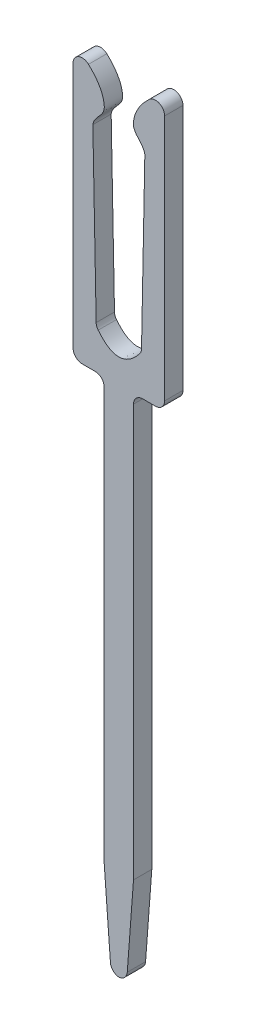
ISO-10303-21;
HEADER;
FILE_DESCRIPTION(('STEP AP214'),'2;1');
FILE_NAME('part.step','',(''),(''),'','','');
FILE_SCHEMA(('AUTOMOTIVE_DESIGN { 1 0 10303 214 1 1 1 1 }'));
ENDSEC;
DATA;
#1=APPLICATION_CONTEXT('core data for automotive mechanical design processes');
#2=APPLICATION_PROTOCOL_DEFINITION('international standard','automotive_design',2000,#1);
#3=PRODUCT_CONTEXT('',#1,'mechanical');
#4=PRODUCT('Part','Part','',(#3));
#5=PRODUCT_RELATED_PRODUCT_CATEGORY('part','',(#4));
#6=PRODUCT_DEFINITION_FORMATION('','',#4);
#7=PRODUCT_DEFINITION_CONTEXT('part definition',#1,'design');
#8=PRODUCT_DEFINITION('design','',#6,#7);
#9=PRODUCT_DEFINITION_SHAPE('','',#8);
#10=(LENGTH_UNIT() NAMED_UNIT(*) SI_UNIT(.MILLI.,.METRE.));
#11=(NAMED_UNIT(*) PLANE_ANGLE_UNIT() SI_UNIT($,.RADIAN.));
#12=(NAMED_UNIT(*) SI_UNIT($,.STERADIAN.) SOLID_ANGLE_UNIT());
#13=UNCERTAINTY_MEASURE_WITH_UNIT(LENGTH_MEASURE(1.E-05),#10,'distance_accuracy_value','');
#14=(GEOMETRIC_REPRESENTATION_CONTEXT(3) GLOBAL_UNCERTAINTY_ASSIGNED_CONTEXT((#13)) GLOBAL_UNIT_ASSIGNED_CONTEXT((#10,
#11,#12)) REPRESENTATION_CONTEXT('',''));
#15=CARTESIAN_POINT('',(0.,0.,0.));
#16=DIRECTION('',(0.,0.,1.));
#17=DIRECTION('',(1.,0.,0.));
#18=AXIS2_PLACEMENT_3D('',#15,#16,#17);
#19=CARTESIAN_POINT('',(0.0155617112013406,-9.53322485209548,-0.2));
#20=DIRECTION('',(0.,0.,1.));
#21=DIRECTION('',(1.,0.,0.));
#22=AXIS2_PLACEMENT_3D('',#19,#20,#21);
#23=CYLINDRICAL_SURFACE('',#22,0.2);
#24=CARTESIAN_POINT('',(0.0155617112013406,-9.53322485209548,0.2));
#25=DIRECTION('',(0.,0.,1.));
#26=DIRECTION('',(-1.,0.,0.));
#27=AXIS2_PLACEMENT_3D('',#24,#25,#26);
#28=CIRCLE('',#27,0.2);
#29=CARTESIAN_POINT('',(-0.183878150776374,-9.54818284174351,0.2));
#30=VERTEX_POINT('',#29);
#31=CARTESIAN_POINT('',(0.,-9.73261851584758,0.2));
#32=VERTEX_POINT('',#31);
#33=EDGE_CURVE('E220',#30,#32,#28,.T.);
#34=ORIENTED_EDGE('',*,*,#33,.F.);
#35=DIRECTION('',(0.,0.,1.));
#36=VECTOR('',#35,1.);
#37=CARTESIAN_POINT('',(-0.183878150776374,-9.54818284174351,-0.2));
#38=LINE('',#37,#36);
#39=CARTESIAN_POINT('',(-0.183878150776374,-9.54818284174351,-0.2));
#40=VERTEX_POINT('',#39);
#41=EDGE_CURVE('E11',#40,#30,#38,.T.);
#42=ORIENTED_EDGE('',*,*,#41,.F.);
#43=CARTESIAN_POINT('',(0.0155617112013406,-9.53322485209548,-0.2));
#44=DIRECTION('',(0.,0.,1.));
#45=DIRECTION('',(-1.,0.,0.));
#46=AXIS2_PLACEMENT_3D('',#43,#44,#45);
#47=CIRCLE('',#46,0.2);
#48=CARTESIAN_POINT('',(0.,-9.73261851584758,-0.2));
#49=VERTEX_POINT('',#48);
#50=EDGE_CURVE('E300',#40,#49,#47,.T.);
#51=ORIENTED_EDGE('',*,*,#50,.T.);
#52=DIRECTION('',(0.,0.,1.));
#53=VECTOR('',#52,1.);
#54=CARTESIAN_POINT('',(0.,-9.73261851584758,-0.2));
#55=LINE('',#54,#53);
#56=EDGE_CURVE('E36',#49,#32,#55,.T.);
#57=ORIENTED_EDGE('',*,*,#56,.T.);
#58=EDGE_LOOP('',(#34,#42,#51,#57));
#59=FACE_BOUND('',#58,.T.);
#60=ADVANCED_FACE('F33',(#59),#23,.T.);
#61=CARTESIAN_POINT('',(-0.183878150776374,-9.54818284174351,-0.2));
#62=DIRECTION('',(-0.997199309888568,-0.074789948240152,0.));
#63=DIRECTION('',(0.074789948240152,-0.997199309888568,0.));
#64=AXIS2_PLACEMENT_3D('',#61,#62,#63);
#65=PLANE('',#64);
#66=DIRECTION('',(0.074789948240152,-0.997199309888568,0.));
#67=VECTOR('',#66,1.);
#68=CARTESIAN_POINT('',(-0.183878150776374,-9.54818284174351,0.2));
#69=LINE('',#68,#67);
#70=CARTESIAN_POINT('',(-0.319999999997298,-7.73322485209503,0.2));
#71=VERTEX_POINT('',#70);
#72=EDGE_CURVE('E298',#71,#30,#69,.T.);
#73=ORIENTED_EDGE('',*,*,#72,.F.);
#74=DIRECTION('',(0.,0.,1.));
#75=VECTOR('',#74,1.);
#76=CARTESIAN_POINT('',(-0.319999999997298,-7.73322485209503,-0.2));
#77=LINE('',#76,#75);
#78=CARTESIAN_POINT('',(-0.319999999997298,-7.73322485209503,-0.2));
#79=VERTEX_POINT('',#78);
#80=EDGE_CURVE('E42',#79,#71,#77,.T.);
#81=ORIENTED_EDGE('',*,*,#80,.F.);
#82=DIRECTION('',(0.074789948240152,-0.997199309888568,0.));
#83=VECTOR('',#82,1.);
#84=CARTESIAN_POINT('',(-0.183878150776374,-9.54818284174351,-0.2));
#85=LINE('',#84,#83);
#86=EDGE_CURVE('E210',#79,#40,#85,.T.);
#87=ORIENTED_EDGE('',*,*,#86,.T.);
#88=ORIENTED_EDGE('',*,*,#41,.T.);
#89=EDGE_LOOP('',(#73,#81,#87,#88));
#90=FACE_BOUND('',#89,.T.);
#91=ADVANCED_FACE('F342',(#90),#65,.T.);
#92=CARTESIAN_POINT('',(-0.319999999997298,-7.73322485209503,-0.2));
#93=DIRECTION('',(-1.,0.,0.));
#94=DIRECTION('',(0.,-1.,0.));
#95=AXIS2_PLACEMENT_3D('',#92,#93,#94);
#96=PLANE('',#95);
#97=DIRECTION('',(0.,-1.,0.));
#98=VECTOR('',#97,1.);
#99=CARTESIAN_POINT('',(-0.319999999997298,-7.73322485209503,0.2));
#100=LINE('',#99,#98);
#101=CARTESIAN_POINT('',(-0.319999999997298,1.26677514790497,0.2));
#102=VERTEX_POINT('',#101);
#103=EDGE_CURVE('E197',#102,#71,#100,.T.);
#104=ORIENTED_EDGE('',*,*,#103,.F.);
#105=DIRECTION('',(0.,0.,1.));
#106=VECTOR('',#105,1.);
#107=CARTESIAN_POINT('',(-0.319999999997298,1.26677514790497,-0.2));
#108=LINE('',#107,#106);
#109=CARTESIAN_POINT('',(-0.319999999997298,1.26677514790497,-0.2));
#110=VERTEX_POINT('',#109);
#111=EDGE_CURVE('E192',#110,#102,#108,.T.);
#112=ORIENTED_EDGE('',*,*,#111,.F.);
#113=DIRECTION('',(0.,-1.,0.));
#114=VECTOR('',#113,1.);
#115=CARTESIAN_POINT('',(-0.319999999997298,-7.73322485209503,-0.2));
#116=LINE('',#115,#114);
#117=EDGE_CURVE('E195',#110,#79,#116,.T.);
#118=ORIENTED_EDGE('',*,*,#117,.T.);
#119=ORIENTED_EDGE('',*,*,#80,.T.);
#120=EDGE_LOOP('',(#104,#112,#118,#119));
#121=FACE_BOUND('',#120,.T.);
#122=ADVANCED_FACE('F194',(#121),#96,.T.);
#123=CARTESIAN_POINT('',(-0.519999999997296,1.26677514790497,-0.2));
#124=DIRECTION('',(0.,0.,1.));
#125=DIRECTION('',(1.,0.,0.));
#126=AXIS2_PLACEMENT_3D('',#123,#124,#125);
#127=CYLINDRICAL_SURFACE('',#126,0.199999999999999);
#128=CARTESIAN_POINT('',(-0.519999999997296,1.26677514790497,0.2));
#129=DIRECTION('',(0.,0.,-1.));
#130=DIRECTION('',(1.,0.,0.));
#131=AXIS2_PLACEMENT_3D('',#128,#129,#130);
#132=CIRCLE('',#131,0.199999999999999);
#133=CARTESIAN_POINT('',(-0.519999999997296,1.46677514790497,0.2));
#134=VERTEX_POINT('',#133);
#135=EDGE_CURVE('E295',#134,#102,#132,.T.);
#136=ORIENTED_EDGE('',*,*,#135,.F.);
#137=DIRECTION('',(0.,0.,1.));
#138=VECTOR('',#137,1.);
#139=CARTESIAN_POINT('',(-0.519999999997296,1.46677514790497,-0.2));
#140=LINE('',#139,#138);
#141=CARTESIAN_POINT('',(-0.519999999997296,1.46677514790497,-0.2));
#142=VERTEX_POINT('',#141);
#143=EDGE_CURVE('E202',#142,#134,#140,.T.);
#144=ORIENTED_EDGE('',*,*,#143,.F.);
#145=CARTESIAN_POINT('',(-0.519999999997296,1.26677514790497,-0.2));
#146=DIRECTION('',(0.,0.,-1.));
#147=DIRECTION('',(1.,0.,0.));
#148=AXIS2_PLACEMENT_3D('',#145,#146,#147);
#149=CIRCLE('',#148,0.199999999999999);
#150=EDGE_CURVE('E208',#142,#110,#149,.T.);
#151=ORIENTED_EDGE('',*,*,#150,.T.);
#152=ORIENTED_EDGE('',*,*,#111,.T.);
#153=EDGE_LOOP('',(#136,#144,#151,#152));
#154=FACE_BOUND('',#153,.T.);
#155=ADVANCED_FACE('F212',(#154),#127,.F.);
#156=CARTESIAN_POINT('',(-0.519999999997296,1.46677514790497,-0.2));
#157=DIRECTION('',(0.,-1.,0.));
#158=DIRECTION('',(0.,0.,-1.));
#159=AXIS2_PLACEMENT_3D('',#156,#157,#158);
#160=PLANE('',#159);
#161=DIRECTION('',(1.,0.,0.));
#162=VECTOR('',#161,1.);
#163=CARTESIAN_POINT('',(-0.519999999997296,1.46677514790497,0.2));
#164=LINE('',#163,#162);
#165=CARTESIAN_POINT('',(-0.799999999997301,1.46677514790497,0.2));
#166=VERTEX_POINT('',#165);
#167=EDGE_CURVE('E292',#166,#134,#164,.T.);
#168=ORIENTED_EDGE('',*,*,#167,.F.);
#169=DIRECTION('',(0.,0.,1.));
#170=VECTOR('',#169,1.);
#171=CARTESIAN_POINT('',(-0.799999999997301,1.46677514790497,-0.2));
#172=LINE('',#171,#170);
#173=CARTESIAN_POINT('',(-0.799999999997301,1.46677514790497,-0.2));
#174=VERTEX_POINT('',#173);
#175=EDGE_CURVE('E304',#174,#166,#172,.T.);
#176=ORIENTED_EDGE('',*,*,#175,.F.);
#177=DIRECTION('',(1.,0.,0.));
#178=VECTOR('',#177,1.);
#179=CARTESIAN_POINT('',(-0.519999999997296,1.46677514790497,-0.2));
#180=LINE('',#179,#178);
#181=EDGE_CURVE('E213',#174,#142,#180,.T.);
#182=ORIENTED_EDGE('',*,*,#181,.T.);
#183=ORIENTED_EDGE('',*,*,#143,.T.);
#184=EDGE_LOOP('',(#168,#176,#182,#183));
#185=FACE_BOUND('',#184,.T.);
#186=ADVANCED_FACE('F355',(#185),#160,.T.);
#187=CARTESIAN_POINT('',(-0.799999999997301,1.66677514790497,-0.2));
#188=DIRECTION('',(0.,0.,1.));
#189=DIRECTION('',(1.,0.,0.));
#190=AXIS2_PLACEMENT_3D('',#187,#188,#189);
#191=CYLINDRICAL_SURFACE('',#190,0.199999999999999);
#192=CARTESIAN_POINT('',(-0.799999999997301,1.66677514790497,0.2));
#193=DIRECTION('',(0.,0.,1.));
#194=DIRECTION('',(-1.,0.,0.));
#195=AXIS2_PLACEMENT_3D('',#192,#193,#194);
#196=CIRCLE('',#195,0.199999999999999);
#197=CARTESIAN_POINT('',(-0.999999999997299,1.66677514790497,0.2));
#198=VERTEX_POINT('',#197);
#199=EDGE_CURVE('E289',#198,#166,#196,.T.);
#200=ORIENTED_EDGE('',*,*,#199,.F.);
#201=DIRECTION('',(0.,0.,1.));
#202=VECTOR('',#201,1.);
#203=CARTESIAN_POINT('',(-0.999999999997299,1.66677514790497,-0.2));
#204=LINE('',#203,#202);
#205=CARTESIAN_POINT('',(-0.999999999997299,1.66677514790497,-0.2));
#206=VERTEX_POINT('',#205);
#207=EDGE_CURVE('E306',#206,#198,#204,.T.);
#208=ORIENTED_EDGE('',*,*,#207,.F.);
#209=CARTESIAN_POINT('',(-0.799999999997301,1.66677514790497,-0.2));
#210=DIRECTION('',(0.,0.,1.));
#211=DIRECTION('',(-1.,0.,0.));
#212=AXIS2_PLACEMENT_3D('',#209,#210,#211);
#213=CIRCLE('',#212,0.199999999999999);
#214=EDGE_CURVE('E215',#206,#174,#213,.T.);
#215=ORIENTED_EDGE('',*,*,#214,.T.);
#216=ORIENTED_EDGE('',*,*,#175,.T.);
#217=EDGE_LOOP('',(#200,#208,#215,#216));
#218=FACE_BOUND('',#217,.T.);
#219=ADVANCED_FACE('F358',(#218),#191,.T.);
#220=CARTESIAN_POINT('',(-0.999999999997299,1.66677514790497,-0.2));
#221=DIRECTION('',(-1.,0.,0.));
#222=DIRECTION('',(0.,0.,1.));
#223=AXIS2_PLACEMENT_3D('',#220,#221,#222);
#224=PLANE('',#223);
#225=DIRECTION('',(0.,-1.,0.));
#226=VECTOR('',#225,1.);
#227=CARTESIAN_POINT('',(-0.999999999997299,1.66677514790497,0.2));
#228=LINE('',#227,#226);
#229=CARTESIAN_POINT('',(-0.999999999997299,7.05719868487585,0.2));
#230=VERTEX_POINT('',#229);
#231=EDGE_CURVE('E286',#230,#198,#228,.T.);
#232=ORIENTED_EDGE('',*,*,#231,.F.);
#233=DIRECTION('',(0.,0.,1.));
#234=VECTOR('',#233,1.);
#235=CARTESIAN_POINT('',(-0.999999999997299,7.05719868487585,-0.2));
#236=LINE('',#235,#234);
#237=CARTESIAN_POINT('',(-0.999999999997299,7.05719868487585,-0.2));
#238=VERTEX_POINT('',#237);
#239=EDGE_CURVE('E308',#238,#230,#236,.T.);
#240=ORIENTED_EDGE('',*,*,#239,.F.);
#241=DIRECTION('',(0.,-1.,0.));
#242=VECTOR('',#241,1.);
#243=CARTESIAN_POINT('',(-0.999999999997299,1.66677514790497,-0.2));
#244=LINE('',#243,#242);
#245=EDGE_CURVE('E393',#238,#206,#244,.T.);
#246=ORIENTED_EDGE('',*,*,#245,.T.);
#247=ORIENTED_EDGE('',*,*,#207,.T.);
#248=EDGE_LOOP('',(#232,#240,#246,#247));
#249=FACE_BOUND('',#248,.T.);
#250=ADVANCED_FACE('F362',(#249),#224,.T.);
#251=CARTESIAN_POINT('',(-0.799999999997313,7.05719868487585,-0.2));
#252=DIRECTION('',(0.,0.,1.));
#253=DIRECTION('',(1.,0.,0.));
#254=AXIS2_PLACEMENT_3D('',#251,#252,#253);
#255=CYLINDRICAL_SURFACE('',#254,0.199999999999987);
#256=CARTESIAN_POINT('',(-0.799999999997313,7.05719868487585,0.2));
#257=DIRECTION('',(0.,0.,1.));
#258=DIRECTION('',(-1.,0.,0.));
#259=AXIS2_PLACEMENT_3D('',#256,#257,#258);
#260=CIRCLE('',#259,0.199999999999987);
#261=CARTESIAN_POINT('',(-0.663039519004161,7.20294444517823,0.2));
#262=VERTEX_POINT('',#261);
#263=EDGE_CURVE('E280',#262,#230,#260,.T.);
#264=ORIENTED_EDGE('',*,*,#263,.F.);
#265=DIRECTION('',(0.,0.,1.));
#266=VECTOR('',#265,1.);
#267=CARTESIAN_POINT('',(-0.663039519004161,7.20294444517823,-0.2));
#268=LINE('',#267,#266);
#269=CARTESIAN_POINT('',(-0.663039519004161,7.20294444517823,-0.2));
#270=VERTEX_POINT('',#269);
#271=EDGE_CURVE('E310',#270,#262,#268,.T.);
#272=ORIENTED_EDGE('',*,*,#271,.F.);
#273=CARTESIAN_POINT('',(-0.799999999997313,7.05719868487585,-0.2));
#274=DIRECTION('',(0.,0.,1.));
#275=DIRECTION('',(-1.,0.,0.));
#276=AXIS2_PLACEMENT_3D('',#273,#274,#275);
#277=CIRCLE('',#276,0.199999999999987);
#278=EDGE_CURVE('E385',#270,#238,#277,.T.);
#279=ORIENTED_EDGE('',*,*,#278,.T.);
#280=ORIENTED_EDGE('',*,*,#239,.T.);
#281=EDGE_LOOP('',(#264,#272,#279,#280));
#282=FACE_BOUND('',#281,.T.);
#283=ADVANCED_FACE('F366',(#282),#255,.T.);
#284=CARTESIAN_POINT('',(-0.567669207755582,6.10834496937554,-0.2));
#285=CARTESIAN_POINT('',(-0.548453887561712,6.27598469580024,-0.2));
#286=CARTESIAN_POINT('',(-0.31067113223224,6.38824738927313,-0.2));
#287=CARTESIAN_POINT('',(-0.326177603548469,6.81615503897428,-0.2));
#288=CARTESIAN_POINT('',(-0.487599251440381,7.03807938574774,-0.2));
#289=CARTESIAN_POINT('',(-0.663039519004161,7.20294444517823,-0.2));
#290=B_SPLINE_CURVE_WITH_KNOTS('',3,(#284,#285,#286,#287,#288,#289),.UNSPECIFIED.,.F.,.F.,(4,1,
1,4),(0.253308427317744,0.546240991694777,0.590136450844154,1.),.UNSPECIFIED.);
#291=DIRECTION('',(0.,0.,1.));
#292=VECTOR('',#291,1.);
#293=SURFACE_OF_LINEAR_EXTRUSION('',#290,#292);
#294=CARTESIAN_POINT('',(-0.567669207755582,6.10834496937554,0.2));
#295=CARTESIAN_POINT('',(-0.548453887561712,6.27598469580024,0.2));
#296=CARTESIAN_POINT('',(-0.31067113223224,6.38824738927313,0.2));
#297=CARTESIAN_POINT('',(-0.326177603548469,6.81615503897428,0.2));
#298=CARTESIAN_POINT('',(-0.487599251440381,7.03807938574774,0.2));
#299=CARTESIAN_POINT('',(-0.663039519004161,7.20294444517823,0.2));
#300=B_SPLINE_CURVE_WITH_KNOTS('',3,(#294,#295,#296,#297,#298,#299),.UNSPECIFIED.,.F.,.F.,(4,1,
1,4),(0.253308427317744,0.546240991694777,0.590136450844154,1.),.UNSPECIFIED.);
#301=CARTESIAN_POINT('',(-0.567669207755582,6.10834496937554,0.2));
#302=VERTEX_POINT('',#301);
#303=EDGE_CURVE('E275',#302,#262,#300,.T.);
#304=ORIENTED_EDGE('',*,*,#303,.F.);
#305=DIRECTION('',(0.,0.,1.));
#306=VECTOR('',#305,1.);
#307=CARTESIAN_POINT('',(-0.567669207755582,6.10834496937554,-0.2));
#308=LINE('',#307,#306);
#309=CARTESIAN_POINT('',(-0.567669207755582,6.10834496937554,-0.2));
#310=VERTEX_POINT('',#309);
#311=EDGE_CURVE('E312',#310,#302,#308,.T.);
#312=ORIENTED_EDGE('',*,*,#311,.F.);
#313=EDGE_CURVE('E378',#310,#270,#290,.T.);
#314=ORIENTED_EDGE('',*,*,#313,.T.);
#315=ORIENTED_EDGE('',*,*,#271,.T.);
#316=EDGE_LOOP('',(#304,#312,#314,#315));
#317=FACE_BOUND('',#316,.T.);
#318=ADVANCED_FACE('F370',(#317),#293,.T.);
#319=CARTESIAN_POINT('',(-0.567669207755582,6.10834496937554,-0.2));
#320=DIRECTION('',(0.999809016262246,0.0195430550508496,0.));
#321=DIRECTION('',(-0.0195430550508496,0.999809016262246,0.));
#322=AXIS2_PLACEMENT_3D('',#319,#320,#321);
#323=PLANE('',#322);
#324=DIRECTION('',(-0.0195430550508496,0.999809016262246,0.));
#325=VECTOR('',#324,1.);
#326=CARTESIAN_POINT('',(-0.567669207755582,6.10834496937554,0.2));
#327=LINE('',#326,#325);
#328=CARTESIAN_POINT('',(-0.495215905001466,2.40168471778945,0.2));
#329=VERTEX_POINT('',#328);
#330=EDGE_CURVE('E272',#329,#302,#327,.T.);
#331=ORIENTED_EDGE('',*,*,#330,.F.);
#332=DIRECTION('',(0.,0.,1.));
#333=VECTOR('',#332,1.);
#334=CARTESIAN_POINT('',(-0.495215905001466,2.40168471778945,-0.2));
#335=LINE('',#334,#333);
#336=CARTESIAN_POINT('',(-0.495215905001466,2.40168471778945,-0.2));
#337=VERTEX_POINT('',#336);
#338=EDGE_CURVE('E314',#337,#329,#335,.T.);
#339=ORIENTED_EDGE('',*,*,#338,.F.);
#340=DIRECTION('',(-0.0195430550508496,0.999809016262246,0.));
#341=VECTOR('',#340,1.);
#342=CARTESIAN_POINT('',(-0.567669207755582,6.10834496937554,-0.2));
#343=LINE('',#342,#341);
#344=EDGE_CURVE('E386',#337,#310,#343,.T.);
#345=ORIENTED_EDGE('',*,*,#344,.T.);
#346=ORIENTED_EDGE('',*,*,#311,.T.);
#347=EDGE_LOOP('',(#331,#339,#345,#346));
#348=FACE_BOUND('',#347,.T.);
#349=ADVANCED_FACE('F375',(#348),#323,.T.);
#350=CARTESIAN_POINT('',(-0.295254101749009,2.40559332879962,-0.2));
#351=DIRECTION('',(0.,0.,1.));
#352=DIRECTION('',(1.,0.,0.));
#353=AXIS2_PLACEMENT_3D('',#350,#351,#352);
#354=CYLINDRICAL_SURFACE('',#353,0.200000000000008);
#355=CARTESIAN_POINT('',(-0.295254101749009,2.40559332879962,0.2));
#356=DIRECTION('',(0.,0.,-1.));
#357=DIRECTION('',(1.,0.,0.));
#358=AXIS2_PLACEMENT_3D('',#355,#356,#357);
#359=CIRCLE('',#358,0.200000000000008);
#360=CARTESIAN_POINT('',(-0.451053838511068,2.28018821716187,0.2));
#361=VERTEX_POINT('',#360);
#362=EDGE_CURVE('E266',#361,#329,#359,.T.);
#363=ORIENTED_EDGE('',*,*,#362,.F.);
#364=DIRECTION('',(0.,0.,1.));
#365=VECTOR('',#364,1.);
#366=CARTESIAN_POINT('',(-0.451053838511068,2.28018821716187,-0.2));
#367=LINE('',#366,#365);
#368=CARTESIAN_POINT('',(-0.451053838511068,2.28018821716187,-0.2));
#369=VERTEX_POINT('',#368);
#370=EDGE_CURVE('E316',#369,#361,#367,.T.);
#371=ORIENTED_EDGE('',*,*,#370,.F.);
#372=CARTESIAN_POINT('',(-0.295254101749009,2.40559332879962,-0.2));
#373=DIRECTION('',(0.,0.,-1.));
#374=DIRECTION('',(1.,0.,0.));
#375=AXIS2_PLACEMENT_3D('',#372,#373,#374);
#376=CIRCLE('',#375,0.200000000000008);
#377=EDGE_CURVE('E411',#369,#337,#376,.T.);
#378=ORIENTED_EDGE('',*,*,#377,.T.);
#379=ORIENTED_EDGE('',*,*,#338,.T.);
#380=EDGE_LOOP('',(#363,#371,#378,#379));
#381=FACE_BOUND('',#380,.T.);
#382=ADVANCED_FACE('F430',(#381),#354,.F.);
#383=CARTESIAN_POINT('',(0.451053838511063,2.28018821716187,-0.2));
#384=CARTESIAN_POINT('',(0.,1.71981178283813,-0.2));
#385=CARTESIAN_POINT('',(-0.451053838511063,2.28018821716187,-0.2));
#386=B_SPLINE_CURVE_WITH_KNOTS('',2,(#383,#384,#385),.UNSPECIFIED.,.F.,.F.,(3,3),
(0.0434047342329982,0.956595265767001),.UNSPECIFIED.);
#387=DIRECTION('',(0.,0.,1.));
#388=VECTOR('',#387,1.);
#389=SURFACE_OF_LINEAR_EXTRUSION('',#386,#388);
#390=CARTESIAN_POINT('',(0.451053838511063,2.28018821716187,0.2));
#391=CARTESIAN_POINT('',(0.,1.71981178283813,0.2));
#392=CARTESIAN_POINT('',(-0.451053838511063,2.28018821716187,0.2));
#393=B_SPLINE_CURVE_WITH_KNOTS('',2,(#390,#391,#392),.UNSPECIFIED.,.F.,.F.,(3,3),
(0.0434047342329982,0.956595265767001),.UNSPECIFIED.);
#394=CARTESIAN_POINT('',(0.451053838511063,2.28018821716187,0.2));
#395=VERTEX_POINT('',#394);
#396=EDGE_CURVE('E261',#395,#361,#393,.T.);
#397=ORIENTED_EDGE('',*,*,#396,.F.);
#398=DIRECTION('',(0.,0.,1.));
#399=VECTOR('',#398,1.);
#400=CARTESIAN_POINT('',(0.451053838511063,2.28018821716187,-0.2));
#401=LINE('',#400,#399);
#402=CARTESIAN_POINT('',(0.451053838511063,2.28018821716187,-0.2));
#403=VERTEX_POINT('',#402);
#404=EDGE_CURVE('E318',#403,#395,#401,.T.);
#405=ORIENTED_EDGE('',*,*,#404,.F.);
#406=EDGE_CURVE('E412',#403,#369,#386,.T.);
#407=ORIENTED_EDGE('',*,*,#406,.T.);
#408=ORIENTED_EDGE('',*,*,#370,.T.);
#409=EDGE_LOOP('',(#397,#405,#407,#408));
#410=FACE_BOUND('',#409,.T.);
#411=ADVANCED_FACE('F426',(#410),#389,.T.);
#412=CARTESIAN_POINT('',(0.29525410174901,2.40559332879962,-0.2));
#413=DIRECTION('',(0.,0.,1.));
#414=DIRECTION('',(1.,0.,0.));
#415=AXIS2_PLACEMENT_3D('',#412,#413,#414);
#416=CYLINDRICAL_SURFACE('',#415,0.200000000000008);
#417=CARTESIAN_POINT('',(0.29525410174901,2.40559332879962,0.2));
#418=DIRECTION('',(0.,0.,-1.));
#419=DIRECTION('',(-1.,0.,0.));
#420=AXIS2_PLACEMENT_3D('',#417,#418,#419);
#421=CIRCLE('',#420,0.200000000000008);
#422=CARTESIAN_POINT('',(0.495215905001468,2.40168471778945,0.2));
#423=VERTEX_POINT('',#422);
#424=EDGE_CURVE('E258',#423,#395,#421,.T.);
#425=ORIENTED_EDGE('',*,*,#424,.F.);
#426=DIRECTION('',(0.,0.,1.));
#427=VECTOR('',#426,1.);
#428=CARTESIAN_POINT('',(0.495215905001468,2.40168471778945,-0.2));
#429=LINE('',#428,#427);
#430=CARTESIAN_POINT('',(0.495215905001468,2.40168471778945,-0.2));
#431=VERTEX_POINT('',#430);
#432=EDGE_CURVE('E320',#431,#423,#429,.T.);
#433=ORIENTED_EDGE('',*,*,#432,.F.);
#434=CARTESIAN_POINT('',(0.29525410174901,2.40559332879962,-0.2));
#435=DIRECTION('',(0.,0.,-1.));
#436=DIRECTION('',(-1.,0.,0.));
#437=AXIS2_PLACEMENT_3D('',#434,#435,#436);
#438=CIRCLE('',#437,0.200000000000008);
#439=EDGE_CURVE('E415',#431,#403,#438,.T.);
#440=ORIENTED_EDGE('',*,*,#439,.T.);
#441=ORIENTED_EDGE('',*,*,#404,.T.);
#442=EDGE_LOOP('',(#425,#433,#440,#441));
#443=FACE_BOUND('',#442,.T.);
#444=ADVANCED_FACE('F429',(#443),#416,.F.);
#445=CARTESIAN_POINT('',(0.567669207755584,6.10834496937554,-0.2));
#446=DIRECTION('',(-0.999809016262246,0.0195430550508496,0.));
#447=DIRECTION('',(-0.0195430550508496,-0.999809016262246,0.));
#448=AXIS2_PLACEMENT_3D('',#445,#446,#447);
#449=PLANE('',#448);
#450=DIRECTION('',(-0.0195430550508496,-0.999809016262246,0.));
#451=VECTOR('',#450,1.);
#452=CARTESIAN_POINT('',(0.567669207755584,6.10834496937554,0.2));
#453=LINE('',#452,#451);
#454=CARTESIAN_POINT('',(0.567669207755584,6.10834496937554,0.2));
#455=VERTEX_POINT('',#454);
#456=EDGE_CURVE('E252',#455,#423,#453,.T.);
#457=ORIENTED_EDGE('',*,*,#456,.F.);
#458=DIRECTION('',(0.,0.,1.));
#459=VECTOR('',#458,1.);
#460=CARTESIAN_POINT('',(0.567669207755584,6.10834496937554,-0.2));
#461=LINE('',#460,#459);
#462=CARTESIAN_POINT('',(0.567669207755584,6.10834496937554,-0.2));
#463=VERTEX_POINT('',#462);
#464=EDGE_CURVE('E322',#463,#455,#461,.T.);
#465=ORIENTED_EDGE('',*,*,#464,.F.);
#466=DIRECTION('',(-0.0195430550508496,-0.999809016262246,0.));
#467=VECTOR('',#466,1.);
#468=CARTESIAN_POINT('',(0.567669207755584,6.10834496937554,-0.2));
#469=LINE('',#468,#467);
#470=EDGE_CURVE('E452',#463,#431,#469,.T.);
#471=ORIENTED_EDGE('',*,*,#470,.T.);
#472=ORIENTED_EDGE('',*,*,#432,.T.);
#473=EDGE_LOOP('',(#457,#465,#471,#472));
#474=FACE_BOUND('',#473,.T.);
#475=ADVANCED_FACE('F434',(#474),#449,.T.);
#476=CARTESIAN_POINT('',(0.663039519004162,7.20294444517823,-0.2));
#477=CARTESIAN_POINT('',(0.487599251440373,7.03807938574778,-0.2));
#478=CARTESIAN_POINT('',(0.326177603548459,6.8161550389743,-0.2));
#479=CARTESIAN_POINT('',(0.310671132232229,6.38824738927312,-0.2));
#480=CARTESIAN_POINT('',(0.548453887561716,6.27598469580024,-0.2));
#481=CARTESIAN_POINT('',(0.567669207755584,6.10834496937554,-0.2));
#482=B_SPLINE_CURVE_WITH_KNOTS('',3,(#476,#477,#478,#479,#480,#481),.UNSPECIFIED.,.F.,.F.,(4,1,
1,4),(0.253308427317744,0.66317197647359,0.707067435622967,1.),.UNSPECIFIED.);
#483=DIRECTION('',(0.,0.,1.));
#484=VECTOR('',#483,1.);
#485=SURFACE_OF_LINEAR_EXTRUSION('',#482,#484);
#486=CARTESIAN_POINT('',(0.663039519004162,7.20294444517823,0.2));
#487=CARTESIAN_POINT('',(0.487599251440373,7.03807938574778,0.2));
#488=CARTESIAN_POINT('',(0.326177603548459,6.8161550389743,0.2));
#489=CARTESIAN_POINT('',(0.310671132232229,6.38824738927312,0.2));
#490=CARTESIAN_POINT('',(0.548453887561716,6.27598469580024,0.2));
#491=CARTESIAN_POINT('',(0.567669207755584,6.10834496937554,0.2));
#492=B_SPLINE_CURVE_WITH_KNOTS('',3,(#486,#487,#488,#489,#490,#491),.UNSPECIFIED.,.F.,.F.,(4,1,
1,4),(0.253308427317744,0.66317197647359,0.707067435622967,1.),.UNSPECIFIED.);
#493=CARTESIAN_POINT('',(0.663039519004162,7.20294444517823,0.2));
#494=VERTEX_POINT('',#493);
#495=EDGE_CURVE('E247',#494,#455,#492,.T.);
#496=ORIENTED_EDGE('',*,*,#495,.F.);
#497=DIRECTION('',(0.,0.,1.));
#498=VECTOR('',#497,1.);
#499=CARTESIAN_POINT('',(0.663039519004162,7.20294444517823,-0.2));
#500=LINE('',#499,#498);
#501=CARTESIAN_POINT('',(0.663039519004162,7.20294444517823,-0.2));
#502=VERTEX_POINT('',#501);
#503=EDGE_CURVE('E324',#502,#494,#500,.T.);
#504=ORIENTED_EDGE('',*,*,#503,.F.);
#505=EDGE_CURVE('E446',#502,#463,#482,.T.);
#506=ORIENTED_EDGE('',*,*,#505,.T.);
#507=ORIENTED_EDGE('',*,*,#464,.T.);
#508=EDGE_LOOP('',(#496,#504,#506,#507));
#509=FACE_BOUND('',#508,.T.);
#510=ADVANCED_FACE('F438',(#509),#485,.T.);
#511=CARTESIAN_POINT('',(0.799999999997314,7.05719868487585,-0.2));
#512=DIRECTION('',(0.,0.,1.));
#513=DIRECTION('',(1.,0.,0.));
#514=AXIS2_PLACEMENT_3D('',#511,#512,#513);
#515=CYLINDRICAL_SURFACE('',#514,0.199999999999987);
#516=CARTESIAN_POINT('',(0.799999999997314,7.05719868487585,0.2));
#517=DIRECTION('',(0.,0.,1.));
#518=DIRECTION('',(1.,0.,0.));
#519=AXIS2_PLACEMENT_3D('',#516,#517,#518);
#520=CIRCLE('',#519,0.199999999999987);
#521=CARTESIAN_POINT('',(0.999999999997301,7.05719868487585,0.2));
#522=VERTEX_POINT('',#521);
#523=EDGE_CURVE('E244',#522,#494,#520,.T.);
#524=ORIENTED_EDGE('',*,*,#523,.F.);
#525=DIRECTION('',(0.,0.,1.));
#526=VECTOR('',#525,1.);
#527=CARTESIAN_POINT('',(0.999999999997301,7.05719868487585,-0.2));
#528=LINE('',#527,#526);
#529=CARTESIAN_POINT('',(0.999999999997301,7.05719868487585,-0.2));
#530=VERTEX_POINT('',#529);
#531=EDGE_CURVE('E326',#530,#522,#528,.T.);
#532=ORIENTED_EDGE('',*,*,#531,.F.);
#533=CARTESIAN_POINT('',(0.799999999997314,7.05719868487585,-0.2));
#534=DIRECTION('',(0.,0.,1.));
#535=DIRECTION('',(1.,0.,0.));
#536=AXIS2_PLACEMENT_3D('',#533,#534,#535);
#537=CIRCLE('',#536,0.199999999999987);
#538=EDGE_CURVE('E453',#530,#502,#537,.T.);
#539=ORIENTED_EDGE('',*,*,#538,.T.);
#540=ORIENTED_EDGE('',*,*,#503,.T.);
#541=EDGE_LOOP('',(#524,#532,#539,#540));
#542=FACE_BOUND('',#541,.T.);
#543=ADVANCED_FACE('F443',(#542),#515,.T.);
#544=CARTESIAN_POINT('',(0.999999999997301,1.66677514790497,-0.2));
#545=DIRECTION('',(1.,0.,0.));
#546=DIRECTION('',(0.,0.,-1.));
#547=AXIS2_PLACEMENT_3D('',#544,#545,#546);
#548=PLANE('',#547);
#549=DIRECTION('',(0.,1.,0.));
#550=VECTOR('',#549,1.);
#551=CARTESIAN_POINT('',(0.999999999997301,1.66677514790497,0.2));
#552=LINE('',#551,#550);
#553=CARTESIAN_POINT('',(0.999999999997301,1.66677514790497,0.2));
#554=VERTEX_POINT('',#553);
#555=EDGE_CURVE('E241',#554,#522,#552,.T.);
#556=ORIENTED_EDGE('',*,*,#555,.F.);
#557=DIRECTION('',(0.,0.,1.));
#558=VECTOR('',#557,1.);
#559=CARTESIAN_POINT('',(0.999999999997301,1.66677514790497,-0.2));
#560=LINE('',#559,#558);
#561=CARTESIAN_POINT('',(0.999999999997301,1.66677514790497,-0.2));
#562=VERTEX_POINT('',#561);
#563=EDGE_CURVE('E328',#562,#554,#560,.T.);
#564=ORIENTED_EDGE('',*,*,#563,.F.);
#565=DIRECTION('',(0.,1.,0.));
#566=VECTOR('',#565,1.);
#567=CARTESIAN_POINT('',(0.999999999997301,1.66677514790497,-0.2));
#568=LINE('',#567,#566);
#569=EDGE_CURVE('E475',#562,#530,#568,.T.);
#570=ORIENTED_EDGE('',*,*,#569,.T.);
#571=ORIENTED_EDGE('',*,*,#531,.T.);
#572=EDGE_LOOP('',(#556,#564,#570,#571));
#573=FACE_BOUND('',#572,.T.);
#574=ADVANCED_FACE('F515',(#573),#548,.T.);
#575=CARTESIAN_POINT('',(0.799999999997302,1.66677514790497,-0.2));
#576=DIRECTION('',(0.,0.,1.));
#577=DIRECTION('',(1.,0.,0.));
#578=AXIS2_PLACEMENT_3D('',#575,#576,#577);
#579=CYLINDRICAL_SURFACE('',#578,0.199999999999999);
#580=CARTESIAN_POINT('',(0.799999999997302,1.66677514790497,0.2));
#581=DIRECTION('',(0.,0.,1.));
#582=DIRECTION('',(1.,0.,0.));
#583=AXIS2_PLACEMENT_3D('',#580,#581,#582);
#584=CIRCLE('',#583,0.199999999999999);
#585=CARTESIAN_POINT('',(0.799999999997302,1.46677514790497,0.2));
#586=VERTEX_POINT('',#585);
#587=EDGE_CURVE('E238',#586,#554,#584,.T.);
#588=ORIENTED_EDGE('',*,*,#587,.F.);
#589=DIRECTION('',(0.,0.,1.));
#590=VECTOR('',#589,1.);
#591=CARTESIAN_POINT('',(0.799999999997302,1.46677514790497,-0.2));
#592=LINE('',#591,#590);
#593=CARTESIAN_POINT('',(0.799999999997302,1.46677514790497,-0.2));
#594=VERTEX_POINT('',#593);
#595=EDGE_CURVE('E330',#594,#586,#592,.T.);
#596=ORIENTED_EDGE('',*,*,#595,.F.);
#597=CARTESIAN_POINT('',(0.799999999997302,1.66677514790497,-0.2));
#598=DIRECTION('',(0.,0.,1.));
#599=DIRECTION('',(1.,0.,0.));
#600=AXIS2_PLACEMENT_3D('',#597,#598,#599);
#601=CIRCLE('',#600,0.199999999999999);
#602=EDGE_CURVE('E476',#594,#562,#601,.T.);
#603=ORIENTED_EDGE('',*,*,#602,.T.);
#604=ORIENTED_EDGE('',*,*,#563,.T.);
#605=EDGE_LOOP('',(#588,#596,#603,#604));
#606=FACE_BOUND('',#605,.T.);
#607=ADVANCED_FACE('F513',(#606),#579,.T.);
#608=CARTESIAN_POINT('',(0.519999999997298,1.46677514790497,-0.2));
#609=DIRECTION('',(0.,-1.,0.));
#610=DIRECTION('',(0.,0.,-1.));
#611=AXIS2_PLACEMENT_3D('',#608,#609,#610);
#612=PLANE('',#611);
#613=DIRECTION('',(1.,0.,0.));
#614=VECTOR('',#613,1.);
#615=CARTESIAN_POINT('',(0.519999999997298,1.46677514790497,0.2));
#616=LINE('',#615,#614);
#617=CARTESIAN_POINT('',(0.519999999997298,1.46677514790497,0.2));
#618=VERTEX_POINT('',#617);
#619=EDGE_CURVE('E235',#618,#586,#616,.T.);
#620=ORIENTED_EDGE('',*,*,#619,.F.);
#621=DIRECTION('',(0.,0.,1.));
#622=VECTOR('',#621,1.);
#623=CARTESIAN_POINT('',(0.519999999997298,1.46677514790497,-0.2));
#624=LINE('',#623,#622);
#625=CARTESIAN_POINT('',(0.519999999997298,1.46677514790497,-0.2));
#626=VERTEX_POINT('',#625);
#627=EDGE_CURVE('E332',#626,#618,#624,.T.);
#628=ORIENTED_EDGE('',*,*,#627,.F.);
#629=DIRECTION('',(1.,0.,0.));
#630=VECTOR('',#629,1.);
#631=CARTESIAN_POINT('',(0.519999999997298,1.46677514790497,-0.2));
#632=LINE('',#631,#630);
#633=EDGE_CURVE('E479',#626,#594,#632,.T.);
#634=ORIENTED_EDGE('',*,*,#633,.T.);
#635=ORIENTED_EDGE('',*,*,#595,.T.);
#636=EDGE_LOOP('',(#620,#628,#634,#635));
#637=FACE_BOUND('',#636,.T.);
#638=ADVANCED_FACE('F509',(#637),#612,.T.);
#639=CARTESIAN_POINT('',(0.519999999997298,1.26677514790497,-0.2));
#640=DIRECTION('',(0.,0.,1.));
#641=DIRECTION('',(1.,0.,0.));
#642=AXIS2_PLACEMENT_3D('',#639,#640,#641);
#643=CYLINDRICAL_SURFACE('',#642,0.199999999999999);
#644=CARTESIAN_POINT('',(0.519999999997298,1.26677514790497,0.2));
#645=DIRECTION('',(0.,0.,-1.));
#646=DIRECTION('',(-1.,0.,0.));
#647=AXIS2_PLACEMENT_3D('',#644,#645,#646);
#648=CIRCLE('',#647,0.199999999999999);
#649=CARTESIAN_POINT('',(0.319999999997299,1.26677514790497,0.2));
#650=VERTEX_POINT('',#649);
#651=EDGE_CURVE('E232',#650,#618,#648,.T.);
#652=ORIENTED_EDGE('',*,*,#651,.F.);
#653=DIRECTION('',(0.,0.,1.));
#654=VECTOR('',#653,1.);
#655=CARTESIAN_POINT('',(0.319999999997299,1.26677514790497,-0.2));
#656=LINE('',#655,#654);
#657=CARTESIAN_POINT('',(0.319999999997299,1.26677514790497,-0.2));
#658=VERTEX_POINT('',#657);
#659=EDGE_CURVE('E334',#658,#650,#656,.T.);
#660=ORIENTED_EDGE('',*,*,#659,.F.);
#661=CARTESIAN_POINT('',(0.519999999997298,1.26677514790497,-0.2));
#662=DIRECTION('',(0.,0.,-1.));
#663=DIRECTION('',(-1.,0.,0.));
#664=AXIS2_PLACEMENT_3D('',#661,#662,#663);
#665=CIRCLE('',#664,0.199999999999999);
#666=EDGE_CURVE('E484',#658,#626,#665,.T.);
#667=ORIENTED_EDGE('',*,*,#666,.T.);
#668=ORIENTED_EDGE('',*,*,#627,.T.);
#669=EDGE_LOOP('',(#652,#660,#667,#668));
#670=FACE_BOUND('',#669,.T.);
#671=ADVANCED_FACE('F505',(#670),#643,.F.);
#672=CARTESIAN_POINT('',(0.3199999999973,-7.73322485209503,-0.2));
#673=DIRECTION('',(1.,0.,0.));
#674=DIRECTION('',(0.,1.,0.));
#675=AXIS2_PLACEMENT_3D('',#672,#673,#674);
#676=PLANE('',#675);
#677=DIRECTION('',(0.,1.,0.));
#678=VECTOR('',#677,1.);
#679=CARTESIAN_POINT('',(0.3199999999973,-7.73322485209503,0.2));
#680=LINE('',#679,#678);
#681=CARTESIAN_POINT('',(0.3199999999973,-7.73322485209503,0.2));
#682=VERTEX_POINT('',#681);
#683=EDGE_CURVE('E229',#682,#650,#680,.T.);
#684=ORIENTED_EDGE('',*,*,#683,.F.);
#685=DIRECTION('',(0.,0.,1.));
#686=VECTOR('',#685,1.);
#687=CARTESIAN_POINT('',(0.3199999999973,-7.73322485209503,-0.2));
#688=LINE('',#687,#686);
#689=CARTESIAN_POINT('',(0.3199999999973,-7.73322485209503,-0.2));
#690=VERTEX_POINT('',#689);
#691=EDGE_CURVE('E336',#690,#682,#688,.T.);
#692=ORIENTED_EDGE('',*,*,#691,.F.);
#693=DIRECTION('',(0.,1.,0.));
#694=VECTOR('',#693,1.);
#695=CARTESIAN_POINT('',(0.3199999999973,-7.73322485209503,-0.2));
#696=LINE('',#695,#694);
#697=EDGE_CURVE('E487',#690,#658,#696,.T.);
#698=ORIENTED_EDGE('',*,*,#697,.T.);
#699=ORIENTED_EDGE('',*,*,#659,.T.);
#700=EDGE_LOOP('',(#684,#692,#698,#699));
#701=FACE_BOUND('',#700,.T.);
#702=ADVANCED_FACE('F503',(#701),#676,.T.);
#703=CARTESIAN_POINT('',(0.183878150776377,-9.54818284174351,-0.2));
#704=DIRECTION('',(0.997199309888568,-0.0747899482401518,0.));
#705=DIRECTION('',(0.0747899482401518,0.997199309888568,0.));
#706=AXIS2_PLACEMENT_3D('',#703,#704,#705);
#707=PLANE('',#706);
#708=DIRECTION('',(0.0747899482401518,0.997199309888568,0.));
#709=VECTOR('',#708,1.);
#710=CARTESIAN_POINT('',(0.183878150776377,-9.54818284174351,0.2));
#711=LINE('',#710,#709);
#712=CARTESIAN_POINT('',(0.183878150776377,-9.54818284174351,0.2));
#713=VERTEX_POINT('',#712);
#714=EDGE_CURVE('E226',#713,#682,#711,.T.);
#715=ORIENTED_EDGE('',*,*,#714,.F.);
#716=DIRECTION('',(0.,0.,1.));
#717=VECTOR('',#716,1.);
#718=CARTESIAN_POINT('',(0.183878150776377,-9.54818284174351,-0.2));
#719=LINE('',#718,#717);
#720=CARTESIAN_POINT('',(0.183878150776377,-9.54818284174351,-0.2));
#721=VERTEX_POINT('',#720);
#722=EDGE_CURVE('E337',#721,#713,#719,.T.);
#723=ORIENTED_EDGE('',*,*,#722,.F.);
#724=DIRECTION('',(0.0747899482401518,0.997199309888568,0.));
#725=VECTOR('',#724,1.);
#726=CARTESIAN_POINT('',(0.183878150776377,-9.54818284174351,-0.2));
#727=LINE('',#726,#725);
#728=EDGE_CURVE('E490',#721,#690,#727,.T.);
#729=ORIENTED_EDGE('',*,*,#728,.T.);
#730=ORIENTED_EDGE('',*,*,#691,.T.);
#731=EDGE_LOOP('',(#715,#723,#729,#730));
#732=FACE_BOUND('',#731,.T.);
#733=ADVANCED_FACE('F499',(#732),#707,.T.);
#734=CARTESIAN_POINT('',(-0.0155617112013377,-9.53322485209548,-0.2));
#735=DIRECTION('',(0.,0.,1.));
#736=DIRECTION('',(1.,0.,0.));
#737=AXIS2_PLACEMENT_3D('',#734,#735,#736);
#738=CYLINDRICAL_SURFACE('',#737,0.2);
#739=CARTESIAN_POINT('',(-0.0155617112013377,-9.53322485209548,0.2));
#740=DIRECTION('',(0.,0.,1.));
#741=DIRECTION('',(1.,0.,0.));
#742=AXIS2_PLACEMENT_3D('',#739,#740,#741);
#743=CIRCLE('',#742,0.2);
#744=EDGE_CURVE('E223',#32,#713,#743,.T.);
#745=ORIENTED_EDGE('',*,*,#744,.F.);
#746=ORIENTED_EDGE('',*,*,#56,.F.);
#747=CARTESIAN_POINT('',(-0.0155617112013377,-9.53322485209548,-0.2));
#748=DIRECTION('',(0.,0.,1.));
#749=DIRECTION('',(1.,0.,0.));
#750=AXIS2_PLACEMENT_3D('',#747,#748,#749);
#751=CIRCLE('',#750,0.2);
#752=EDGE_CURVE('E493',#49,#721,#751,.T.);
#753=ORIENTED_EDGE('',*,*,#752,.T.);
#754=ORIENTED_EDGE('',*,*,#722,.T.);
#755=EDGE_LOOP('',(#745,#746,#753,#754));
#756=FACE_BOUND('',#755,.T.);
#757=ADVANCED_FACE('F339',(#756),#738,.T.);
#758=CARTESIAN_POINT('',(0.0155617112013406,-9.53322485209548,-0.2));
#759=DIRECTION('',(0.,0.,-1.));
#760=DIRECTION('',(-1.,0.,0.));
#761=AXIS2_PLACEMENT_3D('',#758,#759,#760);
#762=PLANE('',#761);
#763=ORIENTED_EDGE('',*,*,#50,.F.);
#764=ORIENTED_EDGE('',*,*,#86,.F.);
#765=ORIENTED_EDGE('',*,*,#117,.F.);
#766=ORIENTED_EDGE('',*,*,#150,.F.);
#767=ORIENTED_EDGE('',*,*,#181,.F.);
#768=ORIENTED_EDGE('',*,*,#214,.F.);
#769=ORIENTED_EDGE('',*,*,#245,.F.);
#770=ORIENTED_EDGE('',*,*,#278,.F.);
#771=ORIENTED_EDGE('',*,*,#313,.F.);
#772=ORIENTED_EDGE('',*,*,#344,.F.);
#773=ORIENTED_EDGE('',*,*,#377,.F.);
#774=ORIENTED_EDGE('',*,*,#406,.F.);
#775=ORIENTED_EDGE('',*,*,#439,.F.);
#776=ORIENTED_EDGE('',*,*,#470,.F.);
#777=ORIENTED_EDGE('',*,*,#505,.F.);
#778=ORIENTED_EDGE('',*,*,#538,.F.);
#779=ORIENTED_EDGE('',*,*,#569,.F.);
#780=ORIENTED_EDGE('',*,*,#602,.F.);
#781=ORIENTED_EDGE('',*,*,#633,.F.);
#782=ORIENTED_EDGE('',*,*,#666,.F.);
#783=ORIENTED_EDGE('',*,*,#697,.F.);
#784=ORIENTED_EDGE('',*,*,#728,.F.);
#785=ORIENTED_EDGE('',*,*,#752,.F.);
#786=EDGE_LOOP('',(#763,#764,#765,#766,#767,#768,#769,#770,#771,#772,#773,#774,#775,#776,#777,
#778,#779,#780,#781,#782,#783,#784,#785));
#787=FACE_BOUND('',#786,.T.);
#788=ADVANCED_FACE('F206',(#787),#762,.T.);
#789=CARTESIAN_POINT('',(0.0155617112013406,-9.53322485209548,0.2));
#790=DIRECTION('',(0.,0.,-1.));
#791=DIRECTION('',(-1.,0.,0.));
#792=AXIS2_PLACEMENT_3D('',#789,#790,#791);
#793=PLANE('',#792);
#794=ORIENTED_EDGE('',*,*,#33,.T.);
#795=ORIENTED_EDGE('',*,*,#744,.T.);
#796=ORIENTED_EDGE('',*,*,#714,.T.);
#797=ORIENTED_EDGE('',*,*,#683,.T.);
#798=ORIENTED_EDGE('',*,*,#651,.T.);
#799=ORIENTED_EDGE('',*,*,#619,.T.);
#800=ORIENTED_EDGE('',*,*,#587,.T.);
#801=ORIENTED_EDGE('',*,*,#555,.T.);
#802=ORIENTED_EDGE('',*,*,#523,.T.);
#803=ORIENTED_EDGE('',*,*,#495,.T.);
#804=ORIENTED_EDGE('',*,*,#456,.T.);
#805=ORIENTED_EDGE('',*,*,#424,.T.);
#806=ORIENTED_EDGE('',*,*,#396,.T.);
#807=ORIENTED_EDGE('',*,*,#362,.T.);
#808=ORIENTED_EDGE('',*,*,#330,.T.);
#809=ORIENTED_EDGE('',*,*,#303,.T.);
#810=ORIENTED_EDGE('',*,*,#263,.T.);
#811=ORIENTED_EDGE('',*,*,#231,.T.);
#812=ORIENTED_EDGE('',*,*,#199,.T.);
#813=ORIENTED_EDGE('',*,*,#167,.T.);
#814=ORIENTED_EDGE('',*,*,#135,.T.);
#815=ORIENTED_EDGE('',*,*,#103,.T.);
#816=ORIENTED_EDGE('',*,*,#72,.T.);
#817=EDGE_LOOP('',(#794,#795,#796,#797,#798,#799,#800,#801,#802,#803,#804,#805,#806,#807,#808,
#809,#810,#811,#812,#813,#814,#815,#816));
#818=FACE_BOUND('',#817,.T.);
#819=ADVANCED_FACE('F341',(#818),#793,.F.);
#820=CLOSED_SHELL('',(#60,#91,#122,#155,#186,#219,#250,#283,#318,#349,#382,#411,#444,#475,#510,
#543,#574,#607,#638,#671,#702,#733,#757,#788,#819));
#821=MANIFOLD_SOLID_BREP('B2',#820);
#822=ADVANCED_BREP_SHAPE_REPRESENTATION('',(#18,#821),#14);
#823=SHAPE_DEFINITION_REPRESENTATION(#9,#822);
ENDSEC;
END-ISO-10303-21;
